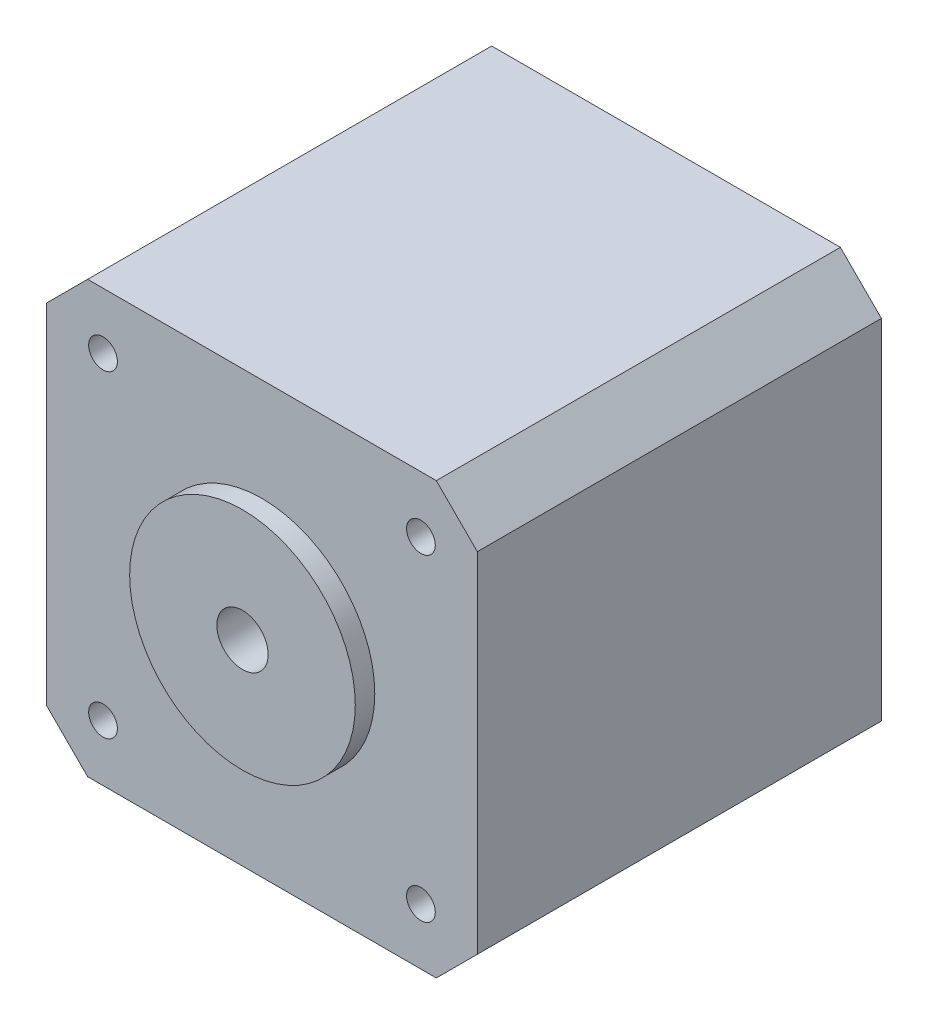
ISO-10303-21;
HEADER;
FILE_DESCRIPTION(('STEP AP214'),'2;1');
FILE_NAME('part.step','',(''),(''),'','','');
FILE_SCHEMA(('AUTOMOTIVE_DESIGN { 1 0 10303 214 1 1 1 1 }'));
ENDSEC;
DATA;
#1=APPLICATION_CONTEXT('core data for automotive mechanical design processes');
#2=APPLICATION_PROTOCOL_DEFINITION('international standard','automotive_design',2000,#1);
#3=PRODUCT_CONTEXT('',#1,'mechanical');
#4=PRODUCT('Part','Part','',(#3));
#5=PRODUCT_RELATED_PRODUCT_CATEGORY('part','',(#4));
#6=PRODUCT_DEFINITION_FORMATION('','',#4);
#7=PRODUCT_DEFINITION_CONTEXT('part definition',#1,'design');
#8=PRODUCT_DEFINITION('design','',#6,#7);
#9=PRODUCT_DEFINITION_SHAPE('','',#8);
#10=(LENGTH_UNIT() NAMED_UNIT(*) SI_UNIT(.MILLI.,.METRE.));
#11=(NAMED_UNIT(*) PLANE_ANGLE_UNIT() SI_UNIT($,.RADIAN.));
#12=(NAMED_UNIT(*) SI_UNIT($,.STERADIAN.) SOLID_ANGLE_UNIT());
#13=UNCERTAINTY_MEASURE_WITH_UNIT(LENGTH_MEASURE(1.E-05),#10,'distance_accuracy_value','');
#14=(GEOMETRIC_REPRESENTATION_CONTEXT(3) GLOBAL_UNCERTAINTY_ASSIGNED_CONTEXT((#13)) GLOBAL_UNIT_ASSIGNED_CONTEXT((#10,
#11,#12)) REPRESENTATION_CONTEXT('',''));
#15=CARTESIAN_POINT('',(0.,0.,0.));
#16=DIRECTION('',(0.,0.,1.));
#17=DIRECTION('',(1.,0.,0.));
#18=AXIS2_PLACEMENT_3D('',#15,#16,#17);
#19=CARTESIAN_POINT('',(42.,0.,39.4));
#20=DIRECTION('',(0.,-1.,0.));
#21=DIRECTION('',(0.,0.,-1.));
#22=AXIS2_PLACEMENT_3D('',#19,#20,#21);
#23=PLANE('',#22);
#24=DIRECTION('',(-1.,0.,0.));
#25=VECTOR('',#24,1.);
#26=CARTESIAN_POINT('',(42.,0.,39.4));
#27=LINE('',#26,#25);
#28=CARTESIAN_POINT('',(38.,0.,39.4));
#29=VERTEX_POINT('',#28);
#30=CARTESIAN_POINT('',(4.,0.,39.4));
#31=VERTEX_POINT('',#30);
#32=EDGE_CURVE('E169',#29,#31,#27,.T.);
#33=ORIENTED_EDGE('',*,*,#32,.T.);
#34=DIRECTION('',(0.,0.,-1.));
#35=VECTOR('',#34,1.);
#36=CARTESIAN_POINT('',(3.99999999999999,0.,39.4));
#37=LINE('',#36,#35);
#38=CARTESIAN_POINT('',(4.,0.,0.));
#39=VERTEX_POINT('',#38);
#40=EDGE_CURVE('E198',#31,#39,#37,.T.);
#41=ORIENTED_EDGE('',*,*,#40,.T.);
#42=DIRECTION('',(-1.,0.,0.));
#43=VECTOR('',#42,1.);
#44=CARTESIAN_POINT('',(42.,0.,0.));
#45=LINE('',#44,#43);
#46=CARTESIAN_POINT('',(38.,0.,0.));
#47=VERTEX_POINT('',#46);
#48=EDGE_CURVE('E159',#47,#39,#45,.T.);
#49=ORIENTED_EDGE('',*,*,#48,.F.);
#50=DIRECTION('',(0.,0.,1.));
#51=VECTOR('',#50,1.);
#52=CARTESIAN_POINT('',(38.,0.,39.4));
#53=LINE('',#52,#51);
#54=EDGE_CURVE('E195',#47,#29,#53,.T.);
#55=ORIENTED_EDGE('',*,*,#54,.T.);
#56=EDGE_LOOP('',(#33,#41,#49,#55));
#57=FACE_BOUND('',#56,.T.);
#58=ADVANCED_FACE('F38',(#57),#23,.T.);
#59=CARTESIAN_POINT('',(42.,42.,39.4));
#60=DIRECTION('',(1.,0.,0.));
#61=DIRECTION('',(0.,0.,-1.));
#62=AXIS2_PLACEMENT_3D('',#59,#60,#61);
#63=PLANE('',#62);
#64=DIRECTION('',(0.,-1.,0.));
#65=VECTOR('',#64,1.);
#66=CARTESIAN_POINT('',(42.,42.,39.4));
#67=LINE('',#66,#65);
#68=CARTESIAN_POINT('',(42.,38.,39.4));
#69=VERTEX_POINT('',#68);
#70=CARTESIAN_POINT('',(42.,4.,39.4));
#71=VERTEX_POINT('',#70);
#72=EDGE_CURVE('E181',#69,#71,#67,.T.);
#73=ORIENTED_EDGE('',*,*,#72,.T.);
#74=DIRECTION('',(0.,0.,-1.));
#75=VECTOR('',#74,1.);
#76=CARTESIAN_POINT('',(42.,3.99999999999999,39.4));
#77=LINE('',#76,#75);
#78=CARTESIAN_POINT('',(42.,4.,0.));
#79=VERTEX_POINT('',#78);
#80=EDGE_CURVE('E235',#71,#79,#77,.T.);
#81=ORIENTED_EDGE('',*,*,#80,.T.);
#82=DIRECTION('',(0.,-1.,0.));
#83=VECTOR('',#82,1.);
#84=CARTESIAN_POINT('',(42.,42.,0.));
#85=LINE('',#84,#83);
#86=CARTESIAN_POINT('',(42.,38.,0.));
#87=VERTEX_POINT('',#86);
#88=EDGE_CURVE('E174',#87,#79,#85,.T.);
#89=ORIENTED_EDGE('',*,*,#88,.F.);
#90=DIRECTION('',(0.,0.,1.));
#91=VECTOR('',#90,1.);
#92=CARTESIAN_POINT('',(42.,38.,39.4));
#93=LINE('',#92,#91);
#94=EDGE_CURVE('E232',#87,#69,#93,.T.);
#95=ORIENTED_EDGE('',*,*,#94,.T.);
#96=EDGE_LOOP('',(#73,#81,#89,#95));
#97=FACE_BOUND('',#96,.T.);
#98=ADVANCED_FACE('F269',(#97),#63,.T.);
#99=CARTESIAN_POINT('',(0.,42.,39.4));
#100=DIRECTION('',(0.,1.,0.));
#101=DIRECTION('',(0.,0.,1.));
#102=AXIS2_PLACEMENT_3D('',#99,#100,#101);
#103=PLANE('',#102);
#104=DIRECTION('',(1.,0.,0.));
#105=VECTOR('',#104,1.);
#106=CARTESIAN_POINT('',(0.,42.,0.));
#107=LINE('',#106,#105);
#108=CARTESIAN_POINT('',(4.00000000000003,42.,0.));
#109=VERTEX_POINT('',#108);
#110=CARTESIAN_POINT('',(38.,42.,0.));
#111=VERTEX_POINT('',#110);
#112=EDGE_CURVE('E188',#109,#111,#107,.T.);
#113=ORIENTED_EDGE('',*,*,#112,.F.);
#114=DIRECTION('',(0.,0.,1.));
#115=VECTOR('',#114,1.);
#116=CARTESIAN_POINT('',(4.00000000000003,42.,39.4));
#117=LINE('',#116,#115);
#118=CARTESIAN_POINT('',(4.00000000000003,42.,39.4));
#119=VERTEX_POINT('',#118);
#120=EDGE_CURVE('E11',#109,#119,#117,.T.);
#121=ORIENTED_EDGE('',*,*,#120,.T.);
#122=DIRECTION('',(1.,0.,0.));
#123=VECTOR('',#122,1.);
#124=CARTESIAN_POINT('',(0.,42.,39.4));
#125=LINE('',#124,#123);
#126=CARTESIAN_POINT('',(38.,42.,39.4));
#127=VERTEX_POINT('',#126);
#128=EDGE_CURVE('E178',#119,#127,#125,.T.);
#129=ORIENTED_EDGE('',*,*,#128,.T.);
#130=DIRECTION('',(0.,0.,-1.));
#131=VECTOR('',#130,1.);
#132=CARTESIAN_POINT('',(38.,42.,39.4));
#133=LINE('',#132,#131);
#134=EDGE_CURVE('E48',#127,#111,#133,.T.);
#135=ORIENTED_EDGE('',*,*,#134,.T.);
#136=EDGE_LOOP('',(#113,#121,#129,#135));
#137=FACE_BOUND('',#136,.T.);
#138=ADVANCED_FACE('F242',(#137),#103,.T.);
#139=CARTESIAN_POINT('',(0.,0.,39.4));
#140=DIRECTION('',(-1.,0.,0.));
#141=DIRECTION('',(0.,0.,1.));
#142=AXIS2_PLACEMENT_3D('',#139,#140,#141);
#143=PLANE('',#142);
#144=DIRECTION('',(0.,1.,0.));
#145=VECTOR('',#144,1.);
#146=CARTESIAN_POINT('',(0.,0.,0.));
#147=LINE('',#146,#145);
#148=CARTESIAN_POINT('',(0.,4.00000000000002,0.));
#149=VERTEX_POINT('',#148);
#150=CARTESIAN_POINT('',(0.,13.,0.));
#151=VERTEX_POINT('',#150);
#152=EDGE_CURVE('E156',#149,#151,#147,.T.);
#153=ORIENTED_EDGE('',*,*,#152,.F.);
#154=DIRECTION('',(0.,0.,1.));
#155=VECTOR('',#154,1.);
#156=CARTESIAN_POINT('',(0.,4.00000000000002,39.4));
#157=LINE('',#156,#155);
#158=CARTESIAN_POINT('',(0.,4.00000000000002,39.4));
#159=VERTEX_POINT('',#158);
#160=EDGE_CURVE('E218',#149,#159,#157,.T.);
#161=ORIENTED_EDGE('',*,*,#160,.T.);
#162=DIRECTION('',(0.,1.,0.));
#163=VECTOR('',#162,1.);
#164=CARTESIAN_POINT('',(0.,0.,39.4));
#165=LINE('',#164,#163);
#166=CARTESIAN_POINT('',(0.,38.,39.4));
#167=VERTEX_POINT('',#166);
#168=EDGE_CURVE('E173',#159,#167,#165,.T.);
#169=ORIENTED_EDGE('',*,*,#168,.T.);
#170=DIRECTION('',(0.,0.,-1.));
#171=VECTOR('',#170,1.);
#172=CARTESIAN_POINT('',(0.,38.,39.4));
#173=LINE('',#172,#171);
#174=CARTESIAN_POINT('',(0.,38.,0.));
#175=VERTEX_POINT('',#174);
#176=EDGE_CURVE('E214',#167,#175,#173,.T.);
#177=ORIENTED_EDGE('',*,*,#176,.T.);
#178=CARTESIAN_POINT('',(0.,29.,0.));
#179=VERTEX_POINT('',#178);
#180=EDGE_CURVE('E163',#179,#175,#147,.T.);
#181=ORIENTED_EDGE('',*,*,#180,.F.);
#182=DIRECTION('',(0.,0.,-1.));
#183=VECTOR('',#182,1.);
#184=CARTESIAN_POINT('',(0.,29.,0.));
#185=LINE('',#184,#183);
#186=CARTESIAN_POINT('',(0.,29.,10.5));
#187=VERTEX_POINT('',#186);
#188=EDGE_CURVE('E151',#187,#179,#185,.T.);
#189=ORIENTED_EDGE('',*,*,#188,.F.);
#190=DIRECTION('',(0.,1.,0.));
#191=VECTOR('',#190,1.);
#192=CARTESIAN_POINT('',(0.,29.,10.5));
#193=LINE('',#192,#191);
#194=CARTESIAN_POINT('',(0.,13.,10.5));
#195=VERTEX_POINT('',#194);
#196=EDGE_CURVE('E502',#195,#187,#193,.T.);
#197=ORIENTED_EDGE('',*,*,#196,.F.);
#198=DIRECTION('',(0.,0.,1.));
#199=VECTOR('',#198,1.);
#200=CARTESIAN_POINT('',(0.,13.,10.5));
#201=LINE('',#200,#199);
#202=EDGE_CURVE('E499',#151,#195,#201,.T.);
#203=ORIENTED_EDGE('',*,*,#202,.F.);
#204=EDGE_LOOP('',(#153,#161,#169,#177,#181,#189,#197,#203));
#205=FACE_BOUND('',#204,.T.);
#206=ADVANCED_FACE('F251',(#205),#143,.T.);
#207=CARTESIAN_POINT('',(0.,0.,39.4));
#208=DIRECTION('',(0.,0.,-1.));
#209=DIRECTION('',(-1.,0.,0.));
#210=AXIS2_PLACEMENT_3D('',#207,#208,#209);
#211=PLANE('',#210);
#212=CARTESIAN_POINT('',(36.5,5.5,39.4));
#213=DIRECTION('',(0.,0.,1.));
#214=DIRECTION('',(1.,0.,0.));
#215=AXIS2_PLACEMENT_3D('',#212,#213,#214);
#216=CIRCLE('',#215,1.39999999999999);
#217=CARTESIAN_POINT('',(37.9,5.5,39.4));
#218=VERTEX_POINT('',#217);
#219=EDGE_CURVE('E540',#218,#218,#216,.T.);
#220=ORIENTED_EDGE('',*,*,#219,.F.);
#221=EDGE_LOOP('',(#220));
#222=FACE_BOUND('',#221,.T.);
#223=CARTESIAN_POINT('',(5.5,5.5,39.4));
#224=DIRECTION('',(0.,0.,1.));
#225=DIRECTION('',(1.,0.,0.));
#226=AXIS2_PLACEMENT_3D('',#223,#224,#225);
#227=CIRCLE('',#226,1.39999999999999);
#228=CARTESIAN_POINT('',(6.89999999999999,5.5,39.4));
#229=VERTEX_POINT('',#228);
#230=EDGE_CURVE('E532',#229,#229,#227,.T.);
#231=ORIENTED_EDGE('',*,*,#230,.F.);
#232=EDGE_LOOP('',(#231));
#233=FACE_BOUND('',#232,.T.);
#234=CARTESIAN_POINT('',(36.5,36.5,39.4));
#235=DIRECTION('',(0.,0.,1.));
#236=DIRECTION('',(1.,0.,0.));
#237=AXIS2_PLACEMENT_3D('',#234,#235,#236);
#238=CIRCLE('',#237,1.39999999999999);
#239=CARTESIAN_POINT('',(37.9,36.5,39.4));
#240=VERTEX_POINT('',#239);
#241=EDGE_CURVE('E524',#240,#240,#238,.T.);
#242=ORIENTED_EDGE('',*,*,#241,.F.);
#243=EDGE_LOOP('',(#242));
#244=FACE_BOUND('',#243,.T.);
#245=CARTESIAN_POINT('',(5.5,36.5,39.4));
#246=DIRECTION('',(0.,0.,1.));
#247=DIRECTION('',(1.,0.,0.));
#248=AXIS2_PLACEMENT_3D('',#245,#246,#247);
#249=CIRCLE('',#248,1.39999999999999);
#250=CARTESIAN_POINT('',(6.89999999999999,36.5,39.4));
#251=VERTEX_POINT('',#250);
#252=EDGE_CURVE('E517',#251,#251,#249,.T.);
#253=ORIENTED_EDGE('',*,*,#252,.F.);
#254=EDGE_LOOP('',(#253));
#255=FACE_BOUND('',#254,.T.);
#256=CARTESIAN_POINT('',(21.,21.,39.4));
#257=DIRECTION('',(0.,0.,1.));
#258=DIRECTION('',(1.,0.,0.));
#259=AXIS2_PLACEMENT_3D('',#256,#257,#258);
#260=CIRCLE('',#259,11.);
#261=CARTESIAN_POINT('',(32.,21.,39.4));
#262=VERTEX_POINT('',#261);
#263=EDGE_CURVE('E184',#262,#262,#260,.T.);
#264=ORIENTED_EDGE('',*,*,#263,.F.);
#265=EDGE_LOOP('',(#264));
#266=FACE_BOUND('',#265,.T.);
#267=ORIENTED_EDGE('',*,*,#168,.F.);
#268=DIRECTION('',(-0.707106781186545,0.70710678118655,0.));
#269=VECTOR('',#268,1.);
#270=CARTESIAN_POINT('',(3.99999999999999,0.,39.4));
#271=LINE('',#270,#269);
#272=EDGE_CURVE('E229',#159,#31,#271,.F.);
#273=ORIENTED_EDGE('',*,*,#272,.T.);
#274=ORIENTED_EDGE('',*,*,#32,.F.);
#275=DIRECTION('',(-0.70710678118655,-0.707106781186545,0.));
#276=VECTOR('',#275,1.);
#277=CARTESIAN_POINT('',(42.,3.99999999999999,39.4));
#278=LINE('',#277,#276);
#279=EDGE_CURVE('E226',#29,#71,#278,.F.);
#280=ORIENTED_EDGE('',*,*,#279,.T.);
#281=ORIENTED_EDGE('',*,*,#72,.F.);
#282=DIRECTION('',(0.707106781186545,-0.70710678118655,0.));
#283=VECTOR('',#282,1.);
#284=CARTESIAN_POINT('',(38.,42.,39.4));
#285=LINE('',#284,#283);
#286=EDGE_CURVE('E55',#69,#127,#285,.F.);
#287=ORIENTED_EDGE('',*,*,#286,.T.);
#288=ORIENTED_EDGE('',*,*,#128,.F.);
#289=DIRECTION('',(0.70710678118655,0.707106781186545,0.));
#290=VECTOR('',#289,1.);
#291=CARTESIAN_POINT('',(0.,38.,39.4));
#292=LINE('',#291,#290);
#293=EDGE_CURVE('E223',#119,#167,#292,.F.);
#294=ORIENTED_EDGE('',*,*,#293,.T.);
#295=EDGE_LOOP('',(#267,#273,#274,#280,#281,#287,#288,#294));
#296=FACE_BOUND('',#295,.T.);
#297=ADVANCED_FACE('F256',(#222,#233,#244,#255,#266,#296),#211,.F.);
#298=CARTESIAN_POINT('',(0.,0.,0.));
#299=DIRECTION('',(0.,0.,-1.));
#300=DIRECTION('',(-1.,0.,0.));
#301=AXIS2_PLACEMENT_3D('',#298,#299,#300);
#302=PLANE('',#301);
#303=CARTESIAN_POINT('',(21.,21.,0.));
#304=DIRECTION('',(0.,0.,1.));
#305=DIRECTION('',(1.,0.,0.));
#306=AXIS2_PLACEMENT_3D('',#303,#304,#305);
#307=CIRCLE('',#306,2.5);
#308=CARTESIAN_POINT('',(23.5,21.,0.));
#309=VERTEX_POINT('',#308);
#310=EDGE_CURVE('E547',#309,#309,#307,.T.);
#311=ORIENTED_EDGE('',*,*,#310,.T.);
#312=EDGE_LOOP('',(#311));
#313=FACE_BOUND('',#312,.T.);
#314=ORIENTED_EDGE('',*,*,#48,.T.);
#315=DIRECTION('',(0.707106781186545,-0.70710678118655,0.));
#316=VECTOR('',#315,1.);
#317=CARTESIAN_POINT('',(2.00000000000001,1.99999999999999,0.));
#318=LINE('',#317,#316);
#319=EDGE_CURVE('E211',#39,#149,#318,.F.);
#320=ORIENTED_EDGE('',*,*,#319,.T.);
#321=ORIENTED_EDGE('',*,*,#152,.T.);
#322=DIRECTION('',(1.,0.,0.));
#323=VECTOR('',#322,1.);
#324=CARTESIAN_POINT('',(-6.5,13.,0.));
#325=LINE('',#324,#323);
#326=CARTESIAN_POINT('',(-6.5,13.,0.));
#327=VERTEX_POINT('',#326);
#328=EDGE_CURVE('E134',#327,#151,#325,.T.);
#329=ORIENTED_EDGE('',*,*,#328,.F.);
#330=DIRECTION('',(0.,-1.,0.));
#331=VECTOR('',#330,1.);
#332=CARTESIAN_POINT('',(-6.5,13.,0.));
#333=LINE('',#332,#331);
#334=CARTESIAN_POINT('',(-6.5,29.,0.));
#335=VERTEX_POINT('',#334);
#336=EDGE_CURVE('E141',#335,#327,#333,.T.);
#337=ORIENTED_EDGE('',*,*,#336,.F.);
#338=DIRECTION('',(1.,0.,0.));
#339=VECTOR('',#338,1.);
#340=CARTESIAN_POINT('',(-6.5,29.,0.));
#341=LINE('',#340,#339);
#342=EDGE_CURVE('E498',#335,#179,#341,.T.);
#343=ORIENTED_EDGE('',*,*,#342,.T.);
#344=ORIENTED_EDGE('',*,*,#180,.T.);
#345=DIRECTION('',(-0.70710678118655,-0.707106781186545,0.));
#346=VECTOR('',#345,1.);
#347=CARTESIAN_POINT('',(-19.,19.0000000000001,0.));
#348=LINE('',#347,#346);
#349=EDGE_CURVE('E205',#175,#109,#348,.F.);
#350=ORIENTED_EDGE('',*,*,#349,.T.);
#351=ORIENTED_EDGE('',*,*,#112,.T.);
#352=DIRECTION('',(-0.707106781186545,0.70710678118655,0.));
#353=VECTOR('',#352,1.);
#354=CARTESIAN_POINT('',(40.0000000000001,39.9999999999999,0.));
#355=LINE('',#354,#353);
#356=EDGE_CURVE('E202',#111,#87,#355,.F.);
#357=ORIENTED_EDGE('',*,*,#356,.T.);
#358=ORIENTED_EDGE('',*,*,#88,.T.);
#359=DIRECTION('',(0.70710678118655,0.707106781186545,0.));
#360=VECTOR('',#359,1.);
#361=CARTESIAN_POINT('',(18.9999999999999,-19.,0.));
#362=LINE('',#361,#360);
#363=EDGE_CURVE('E208',#79,#47,#362,.F.);
#364=ORIENTED_EDGE('',*,*,#363,.T.);
#365=EDGE_LOOP('',(#314,#320,#321,#329,#337,#343,#344,#350,#351,#357,#358,#364));
#366=FACE_BOUND('',#365,.T.);
#367=ADVANCED_FACE('F154',(#313,#366),#302,.T.);
#368=CARTESIAN_POINT('',(-6.5,13.,10.5));
#369=DIRECTION('',(0.,1.,0.));
#370=DIRECTION('',(0.,0.,1.));
#371=AXIS2_PLACEMENT_3D('',#368,#369,#370);
#372=PLANE('',#371);
#373=ORIENTED_EDGE('',*,*,#202,.T.);
#374=DIRECTION('',(1.,0.,0.));
#375=VECTOR('',#374,1.);
#376=CARTESIAN_POINT('',(-6.5,13.,10.5));
#377=LINE('',#376,#375);
#378=CARTESIAN_POINT('',(-6.5,13.,10.5));
#379=VERTEX_POINT('',#378);
#380=EDGE_CURVE('E136',#379,#195,#377,.T.);
#381=ORIENTED_EDGE('',*,*,#380,.F.);
#382=DIRECTION('',(0.,0.,1.));
#383=VECTOR('',#382,1.);
#384=CARTESIAN_POINT('',(-6.5,13.,10.5));
#385=LINE('',#384,#383);
#386=EDGE_CURVE('E129',#327,#379,#385,.T.);
#387=ORIENTED_EDGE('',*,*,#386,.F.);
#388=ORIENTED_EDGE('',*,*,#328,.T.);
#389=EDGE_LOOP('',(#373,#381,#387,#388));
#390=FACE_BOUND('',#389,.T.);
#391=ADVANCED_FACE('F132',(#390),#372,.F.);
#392=CARTESIAN_POINT('',(-6.5,29.,10.5));
#393=DIRECTION('',(0.,0.,-1.));
#394=DIRECTION('',(-1.,0.,0.));
#395=AXIS2_PLACEMENT_3D('',#392,#393,#394);
#396=PLANE('',#395);
#397=ORIENTED_EDGE('',*,*,#196,.T.);
#398=DIRECTION('',(1.,0.,0.));
#399=VECTOR('',#398,1.);
#400=CARTESIAN_POINT('',(-6.5,29.,10.5));
#401=LINE('',#400,#399);
#402=CARTESIAN_POINT('',(-6.5,29.,10.5));
#403=VERTEX_POINT('',#402);
#404=EDGE_CURVE('E165',#403,#187,#401,.T.);
#405=ORIENTED_EDGE('',*,*,#404,.F.);
#406=DIRECTION('',(0.,1.,0.));
#407=VECTOR('',#406,1.);
#408=CARTESIAN_POINT('',(-6.5,29.,10.5));
#409=LINE('',#408,#407);
#410=EDGE_CURVE('E140',#379,#403,#409,.T.);
#411=ORIENTED_EDGE('',*,*,#410,.F.);
#412=ORIENTED_EDGE('',*,*,#380,.T.);
#413=EDGE_LOOP('',(#397,#405,#411,#412));
#414=FACE_BOUND('',#413,.T.);
#415=ADVANCED_FACE('F452',(#414),#396,.F.);
#416=CARTESIAN_POINT('',(-6.5,29.,0.));
#417=DIRECTION('',(0.,-1.,0.));
#418=DIRECTION('',(0.,0.,-1.));
#419=AXIS2_PLACEMENT_3D('',#416,#417,#418);
#420=PLANE('',#419);
#421=ORIENTED_EDGE('',*,*,#188,.T.);
#422=ORIENTED_EDGE('',*,*,#342,.F.);
#423=DIRECTION('',(0.,0.,-1.));
#424=VECTOR('',#423,1.);
#425=CARTESIAN_POINT('',(-6.5,29.,0.));
#426=LINE('',#425,#424);
#427=EDGE_CURVE('E146',#403,#335,#426,.T.);
#428=ORIENTED_EDGE('',*,*,#427,.F.);
#429=ORIENTED_EDGE('',*,*,#404,.T.);
#430=EDGE_LOOP('',(#421,#422,#428,#429));
#431=FACE_BOUND('',#430,.T.);
#432=ADVANCED_FACE('F460',(#431),#420,.F.);
#433=CARTESIAN_POINT('',(-6.5,0.,0.));
#434=DIRECTION('',(1.,0.,0.));
#435=DIRECTION('',(0.,0.,-1.));
#436=AXIS2_PLACEMENT_3D('',#433,#434,#435);
#437=PLANE('',#436);
#438=ORIENTED_EDGE('',*,*,#336,.T.);
#439=ORIENTED_EDGE('',*,*,#386,.T.);
#440=ORIENTED_EDGE('',*,*,#410,.T.);
#441=ORIENTED_EDGE('',*,*,#427,.T.);
#442=EDGE_LOOP('',(#438,#439,#440,#441));
#443=FACE_BOUND('',#442,.T.);
#444=ADVANCED_FACE('F144',(#443),#437,.F.);
#445=CARTESIAN_POINT('',(21.,21.,41.3));
#446=DIRECTION('',(0.,0.,-1.));
#447=DIRECTION('',(-1.,0.,0.));
#448=AXIS2_PLACEMENT_3D('',#445,#446,#447);
#449=CYLINDRICAL_SURFACE('',#448,11.);
#450=CARTESIAN_POINT('',(21.,21.,41.3));
#451=DIRECTION('',(0.,0.,1.));
#452=DIRECTION('',(1.,0.,0.));
#453=AXIS2_PLACEMENT_3D('',#450,#451,#452);
#454=CIRCLE('',#453,11.);
#455=CARTESIAN_POINT('',(32.,21.,41.3));
#456=VERTEX_POINT('',#455);
#457=EDGE_CURVE('E485',#456,#456,#454,.T.);
#458=ORIENTED_EDGE('',*,*,#457,.F.);
#459=EDGE_LOOP('',(#458));
#460=FACE_BOUND('',#459,.T.);
#461=ORIENTED_EDGE('',*,*,#263,.T.);
#462=EDGE_LOOP('',(#461));
#463=FACE_BOUND('',#462,.T.);
#464=ADVANCED_FACE('F325',(#460,#463),#449,.T.);
#465=CARTESIAN_POINT('',(21.,21.,41.3));
#466=DIRECTION('',(0.,0.,1.));
#467=DIRECTION('',(1.,0.,0.));
#468=AXIS2_PLACEMENT_3D('',#465,#466,#467);
#469=PLANE('',#468);
#470=CARTESIAN_POINT('',(21.,21.,41.3));
#471=DIRECTION('',(0.,0.,1.));
#472=DIRECTION('',(1.,0.,0.));
#473=AXIS2_PLACEMENT_3D('',#470,#471,#472);
#474=CIRCLE('',#473,2.5);
#475=CARTESIAN_POINT('',(23.5,21.,41.3));
#476=VERTEX_POINT('',#475);
#477=EDGE_CURVE('E42',#476,#476,#474,.T.);
#478=ORIENTED_EDGE('',*,*,#477,.F.);
#479=EDGE_LOOP('',(#478));
#480=FACE_BOUND('',#479,.T.);
#481=ORIENTED_EDGE('',*,*,#457,.T.);
#482=EDGE_LOOP('',(#481));
#483=FACE_BOUND('',#482,.T.);
#484=ADVANCED_FACE('F320',(#480,#483),#469,.T.);
#485=CARTESIAN_POINT('',(5.5,36.5,36.4));
#486=DIRECTION('',(0.,0.,-1.));
#487=DIRECTION('',(-1.,0.,0.));
#488=AXIS2_PLACEMENT_3D('',#485,#486,#487);
#489=PLANE('',#488);
#490=CARTESIAN_POINT('',(5.5,36.5,36.4));
#491=DIRECTION('',(0.,0.,1.));
#492=DIRECTION('',(1.,0.,0.));
#493=AXIS2_PLACEMENT_3D('',#490,#491,#492);
#494=CIRCLE('',#493,1.39999999999999);
#495=CARTESIAN_POINT('',(6.89999999999999,36.5,36.4));
#496=VERTEX_POINT('',#495);
#497=EDGE_CURVE('E514',#496,#496,#494,.T.);
#498=ORIENTED_EDGE('',*,*,#497,.T.);
#499=EDGE_LOOP('',(#498));
#500=FACE_BOUND('',#499,.T.);
#501=ADVANCED_FACE('F324',(#500),#489,.F.);
#502=CARTESIAN_POINT('',(5.5,36.5,39.4));
#503=DIRECTION('',(0.,0.,1.));
#504=DIRECTION('',(1.,0.,0.));
#505=AXIS2_PLACEMENT_3D('',#502,#503,#504);
#506=CYLINDRICAL_SURFACE('',#505,1.39999999999999);
#507=ORIENTED_EDGE('',*,*,#497,.F.);
#508=EDGE_LOOP('',(#507));
#509=FACE_BOUND('',#508,.T.);
#510=ORIENTED_EDGE('',*,*,#252,.T.);
#511=EDGE_LOOP('',(#510));
#512=FACE_BOUND('',#511,.T.);
#513=ADVANCED_FACE('F346',(#509,#512),#506,.F.);
#514=CARTESIAN_POINT('',(36.5,36.5,36.4));
#515=DIRECTION('',(0.,0.,-1.));
#516=DIRECTION('',(-1.,0.,0.));
#517=AXIS2_PLACEMENT_3D('',#514,#515,#516);
#518=PLANE('',#517);
#519=CARTESIAN_POINT('',(36.5,36.5,36.4));
#520=DIRECTION('',(0.,0.,1.));
#521=DIRECTION('',(1.,0.,0.));
#522=AXIS2_PLACEMENT_3D('',#519,#520,#521);
#523=CIRCLE('',#522,1.39999999999998);
#524=CARTESIAN_POINT('',(37.9,36.5,36.4));
#525=VERTEX_POINT('',#524);
#526=EDGE_CURVE('E520',#525,#525,#523,.T.);
#527=ORIENTED_EDGE('',*,*,#526,.T.);
#528=EDGE_LOOP('',(#527));
#529=FACE_BOUND('',#528,.T.);
#530=ADVANCED_FACE('F353',(#529),#518,.F.);
#531=CARTESIAN_POINT('',(36.5,36.5,39.4));
#532=DIRECTION('',(0.,0.,1.));
#533=DIRECTION('',(1.,0.,0.));
#534=AXIS2_PLACEMENT_3D('',#531,#532,#533);
#535=CYLINDRICAL_SURFACE('',#534,1.39999999999999);
#536=ORIENTED_EDGE('',*,*,#526,.F.);
#537=EDGE_LOOP('',(#536));
#538=FACE_BOUND('',#537,.T.);
#539=ORIENTED_EDGE('',*,*,#241,.T.);
#540=EDGE_LOOP('',(#539));
#541=FACE_BOUND('',#540,.T.);
#542=ADVANCED_FACE('F361',(#538,#541),#535,.F.);
#543=CARTESIAN_POINT('',(5.5,5.5,36.4));
#544=DIRECTION('',(0.,0.,-1.));
#545=DIRECTION('',(-1.,0.,0.));
#546=AXIS2_PLACEMENT_3D('',#543,#544,#545);
#547=PLANE('',#546);
#548=CARTESIAN_POINT('',(5.5,5.5,36.4));
#549=DIRECTION('',(0.,0.,1.));
#550=DIRECTION('',(1.,0.,0.));
#551=AXIS2_PLACEMENT_3D('',#548,#549,#550);
#552=CIRCLE('',#551,1.39999999999999);
#553=CARTESIAN_POINT('',(6.89999999999999,5.5,36.4));
#554=VERTEX_POINT('',#553);
#555=EDGE_CURVE('E528',#554,#554,#552,.T.);
#556=ORIENTED_EDGE('',*,*,#555,.T.);
#557=EDGE_LOOP('',(#556));
#558=FACE_BOUND('',#557,.T.);
#559=ADVANCED_FACE('F369',(#558),#547,.F.);
#560=CARTESIAN_POINT('',(5.5,5.5,39.4));
#561=DIRECTION('',(0.,0.,1.));
#562=DIRECTION('',(1.,0.,0.));
#563=AXIS2_PLACEMENT_3D('',#560,#561,#562);
#564=CYLINDRICAL_SURFACE('',#563,1.39999999999999);
#565=ORIENTED_EDGE('',*,*,#555,.F.);
#566=EDGE_LOOP('',(#565));
#567=FACE_BOUND('',#566,.T.);
#568=ORIENTED_EDGE('',*,*,#230,.T.);
#569=EDGE_LOOP('',(#568));
#570=FACE_BOUND('',#569,.T.);
#571=ADVANCED_FACE('F377',(#567,#570),#564,.F.);
#572=CARTESIAN_POINT('',(36.5,5.5,36.4));
#573=DIRECTION('',(0.,0.,-1.));
#574=DIRECTION('',(-1.,0.,0.));
#575=AXIS2_PLACEMENT_3D('',#572,#573,#574);
#576=PLANE('',#575);
#577=CARTESIAN_POINT('',(36.5,5.5,36.4));
#578=DIRECTION('',(0.,0.,1.));
#579=DIRECTION('',(1.,0.,0.));
#580=AXIS2_PLACEMENT_3D('',#577,#578,#579);
#581=CIRCLE('',#580,1.39999999999998);
#582=CARTESIAN_POINT('',(37.9,5.5,36.4));
#583=VERTEX_POINT('',#582);
#584=EDGE_CURVE('E536',#583,#583,#581,.T.);
#585=ORIENTED_EDGE('',*,*,#584,.T.);
#586=EDGE_LOOP('',(#585));
#587=FACE_BOUND('',#586,.T.);
#588=ADVANCED_FACE('F385',(#587),#576,.F.);
#589=CARTESIAN_POINT('',(36.5,5.5,39.4));
#590=DIRECTION('',(0.,0.,1.));
#591=DIRECTION('',(1.,0.,0.));
#592=AXIS2_PLACEMENT_3D('',#589,#590,#591);
#593=CYLINDRICAL_SURFACE('',#592,1.39999999999999);
#594=ORIENTED_EDGE('',*,*,#584,.F.);
#595=EDGE_LOOP('',(#594));
#596=FACE_BOUND('',#595,.T.);
#597=ORIENTED_EDGE('',*,*,#219,.T.);
#598=EDGE_LOOP('',(#597));
#599=FACE_BOUND('',#598,.T.);
#600=ADVANCED_FACE('F290',(#596,#599),#593,.F.);
#601=CARTESIAN_POINT('',(3.99999999999999,0.,39.4));
#602=DIRECTION('',(0.70710678118655,0.707106781186545,0.));
#603=DIRECTION('',(0.,0.,-1.));
#604=AXIS2_PLACEMENT_3D('',#601,#602,#603);
#605=PLANE('',#604);
#606=ORIENTED_EDGE('',*,*,#272,.F.);
#607=ORIENTED_EDGE('',*,*,#160,.F.);
#608=ORIENTED_EDGE('',*,*,#319,.F.);
#609=ORIENTED_EDGE('',*,*,#40,.F.);
#610=EDGE_LOOP('',(#606,#607,#608,#609));
#611=FACE_BOUND('',#610,.T.);
#612=ADVANCED_FACE('F260',(#611),#605,.F.);
#613=CARTESIAN_POINT('',(42.,3.99999999999999,39.4));
#614=DIRECTION('',(-0.707106781186545,0.70710678118655,0.));
#615=DIRECTION('',(0.,0.,-1.));
#616=AXIS2_PLACEMENT_3D('',#613,#614,#615);
#617=PLANE('',#616);
#618=ORIENTED_EDGE('',*,*,#279,.F.);
#619=ORIENTED_EDGE('',*,*,#54,.F.);
#620=ORIENTED_EDGE('',*,*,#363,.F.);
#621=ORIENTED_EDGE('',*,*,#80,.F.);
#622=EDGE_LOOP('',(#618,#619,#620,#621));
#623=FACE_BOUND('',#622,.T.);
#624=ADVANCED_FACE('F267',(#623),#617,.F.);
#625=CARTESIAN_POINT('',(0.,38.,39.4));
#626=DIRECTION('',(0.707106781186545,-0.70710678118655,0.));
#627=DIRECTION('',(0.,0.,-1.));
#628=AXIS2_PLACEMENT_3D('',#625,#626,#627);
#629=PLANE('',#628);
#630=ORIENTED_EDGE('',*,*,#293,.F.);
#631=ORIENTED_EDGE('',*,*,#120,.F.);
#632=ORIENTED_EDGE('',*,*,#349,.F.);
#633=ORIENTED_EDGE('',*,*,#176,.F.);
#634=EDGE_LOOP('',(#630,#631,#632,#633));
#635=FACE_BOUND('',#634,.T.);
#636=ADVANCED_FACE('F249',(#635),#629,.F.);
#637=CARTESIAN_POINT('',(38.,42.,39.4));
#638=DIRECTION('',(-0.70710678118655,-0.707106781186545,0.));
#639=DIRECTION('',(0.,0.,-1.));
#640=AXIS2_PLACEMENT_3D('',#637,#638,#639);
#641=PLANE('',#640);
#642=ORIENTED_EDGE('',*,*,#286,.F.);
#643=ORIENTED_EDGE('',*,*,#94,.F.);
#644=ORIENTED_EDGE('',*,*,#356,.F.);
#645=ORIENTED_EDGE('',*,*,#134,.F.);
#646=EDGE_LOOP('',(#642,#643,#644,#645));
#647=FACE_BOUND('',#646,.T.);
#648=ADVANCED_FACE('F40',(#647),#641,.F.);
#649=CARTESIAN_POINT('',(21.,21.,0.));
#650=DIRECTION('',(0.,0.,1.));
#651=DIRECTION('',(1.,0.,0.));
#652=AXIS2_PLACEMENT_3D('',#649,#650,#651);
#653=CYLINDRICAL_SURFACE('',#652,2.5);
#654=ORIENTED_EDGE('',*,*,#477,.T.);
#655=EDGE_LOOP('',(#654));
#656=FACE_BOUND('',#655,.T.);
#657=ORIENTED_EDGE('',*,*,#310,.F.);
#658=EDGE_LOOP('',(#657));
#659=FACE_BOUND('',#658,.T.);
#660=ADVANCED_FACE('F272',(#656,#659),#653,.F.);
#661=CLOSED_SHELL('',(#58,#98,#138,#206,#297,#367,#391,#415,#432,#444,#464,#484,#501,#513,#530,
#542,#559,#571,#588,#600,#612,#624,#636,#648,#660));
#662=MANIFOLD_SOLID_BREP('B2',#661);
#663=ADVANCED_BREP_SHAPE_REPRESENTATION('',(#18,#662),#14);
#664=SHAPE_DEFINITION_REPRESENTATION(#9,#663);
ENDSEC;
END-ISO-10303-21;
